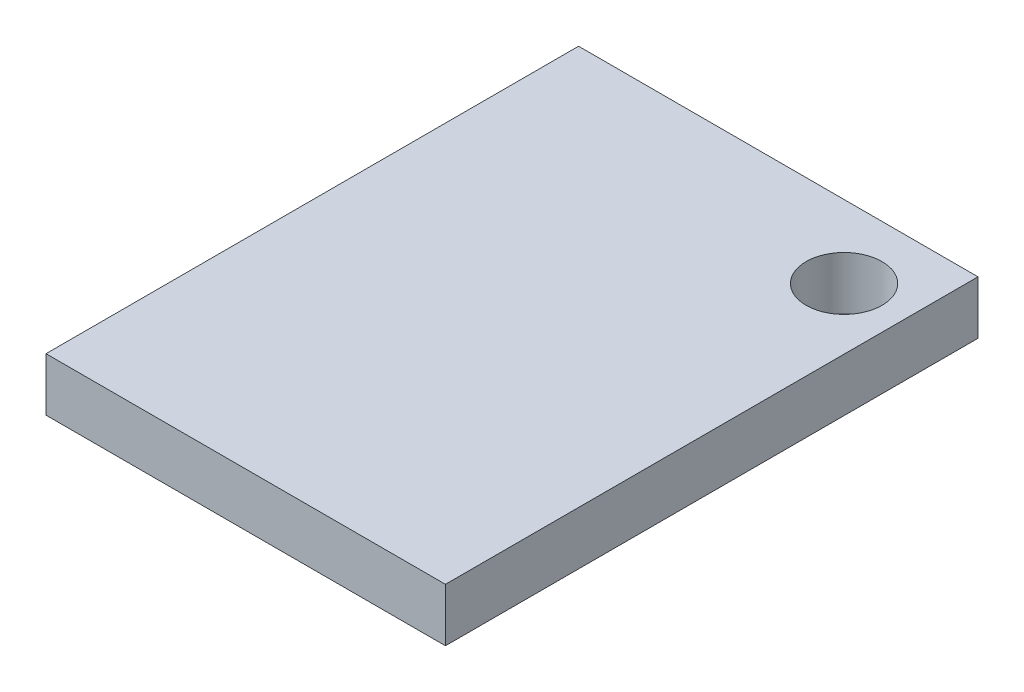
ISO-10303-21;
HEADER;
FILE_DESCRIPTION(('STEP AP214'),'2;1');
FILE_NAME('part.step','',(''),(''),'','','');
FILE_SCHEMA(('AUTOMOTIVE_DESIGN { 1 0 10303 214 1 1 1 1 }'));
ENDSEC;
DATA;
#1=APPLICATION_CONTEXT('core data for automotive mechanical design processes');
#2=APPLICATION_PROTOCOL_DEFINITION('international standard','automotive_design',2000,#1);
#3=PRODUCT_CONTEXT('',#1,'mechanical');
#4=PRODUCT('Part','Part','',(#3));
#5=PRODUCT_RELATED_PRODUCT_CATEGORY('part','',(#4));
#6=PRODUCT_DEFINITION_FORMATION('','',#4);
#7=PRODUCT_DEFINITION_CONTEXT('part definition',#1,'design');
#8=PRODUCT_DEFINITION('design','',#6,#7);
#9=PRODUCT_DEFINITION_SHAPE('','',#8);
#10=(LENGTH_UNIT() NAMED_UNIT(*) SI_UNIT(.MILLI.,.METRE.));
#11=(NAMED_UNIT(*) PLANE_ANGLE_UNIT() SI_UNIT($,.RADIAN.));
#12=(NAMED_UNIT(*) SI_UNIT($,.STERADIAN.) SOLID_ANGLE_UNIT());
#13=UNCERTAINTY_MEASURE_WITH_UNIT(LENGTH_MEASURE(1.E-05),#10,'distance_accuracy_value','');
#14=(GEOMETRIC_REPRESENTATION_CONTEXT(3) GLOBAL_UNCERTAINTY_ASSIGNED_CONTEXT((#13)) GLOBAL_UNIT_ASSIGNED_CONTEXT((#10,
#11,#12)) REPRESENTATION_CONTEXT('',''));
#15=CARTESIAN_POINT('',(0.,0.,0.));
#16=DIRECTION('',(0.,0.,1.));
#17=DIRECTION('',(1.,0.,0.));
#18=AXIS2_PLACEMENT_3D('',#15,#16,#17);
#19=CARTESIAN_POINT('',(7.5,2.,-10.));
#20=DIRECTION('',(-1.,0.,0.));
#21=DIRECTION('',(0.,0.,1.));
#22=AXIS2_PLACEMENT_3D('',#19,#20,#21);
#23=PLANE('',#22);
#24=DIRECTION('',(0.,0.,-1.));
#25=VECTOR('',#24,1.);
#26=CARTESIAN_POINT('',(7.5,0.,-10.));
#27=LINE('',#26,#25);
#28=CARTESIAN_POINT('',(7.5,0.,10.));
#29=VERTEX_POINT('',#28);
#30=CARTESIAN_POINT('',(7.5,0.,-10.));
#31=VERTEX_POINT('',#30);
#32=EDGE_CURVE('E96',#29,#31,#27,.T.);
#33=ORIENTED_EDGE('',*,*,#32,.T.);
#34=DIRECTION('',(0.,-1.,0.));
#35=VECTOR('',#34,1.);
#36=CARTESIAN_POINT('',(7.5,2.,-10.));
#37=LINE('',#36,#35);
#38=CARTESIAN_POINT('',(7.5,2.,-10.));
#39=VERTEX_POINT('',#38);
#40=EDGE_CURVE('E11',#39,#31,#37,.T.);
#41=ORIENTED_EDGE('',*,*,#40,.F.);
#42=DIRECTION('',(0.,0.,-1.));
#43=VECTOR('',#42,1.);
#44=CARTESIAN_POINT('',(7.5,2.,-10.));
#45=LINE('',#44,#43);
#46=CARTESIAN_POINT('',(7.5,2.,10.));
#47=VERTEX_POINT('',#46);
#48=EDGE_CURVE('E84',#47,#39,#45,.T.);
#49=ORIENTED_EDGE('',*,*,#48,.F.);
#50=DIRECTION('',(0.,-1.,0.));
#51=VECTOR('',#50,1.);
#52=CARTESIAN_POINT('',(7.5,2.,10.));
#53=LINE('',#52,#51);
#54=EDGE_CURVE('E92',#47,#29,#53,.T.);
#55=ORIENTED_EDGE('',*,*,#54,.T.);
#56=EDGE_LOOP('',(#33,#41,#49,#55));
#57=FACE_BOUND('',#56,.T.);
#58=ADVANCED_FACE('F33',(#57),#23,.F.);
#59=CARTESIAN_POINT('',(-7.5,2.,-10.));
#60=DIRECTION('',(0.,0.,1.));
#61=DIRECTION('',(1.,0.,0.));
#62=AXIS2_PLACEMENT_3D('',#59,#60,#61);
#63=PLANE('',#62);
#64=DIRECTION('',(-1.,0.,0.));
#65=VECTOR('',#64,1.);
#66=CARTESIAN_POINT('',(-7.5,0.,-10.));
#67=LINE('',#66,#65);
#68=CARTESIAN_POINT('',(-7.5,0.,-10.));
#69=VERTEX_POINT('',#68);
#70=EDGE_CURVE('E88',#31,#69,#67,.T.);
#71=ORIENTED_EDGE('',*,*,#70,.T.);
#72=DIRECTION('',(0.,-1.,0.));
#73=VECTOR('',#72,1.);
#74=CARTESIAN_POINT('',(-7.5,2.,-10.));
#75=LINE('',#74,#73);
#76=CARTESIAN_POINT('',(-7.5,2.,-10.));
#77=VERTEX_POINT('',#76);
#78=EDGE_CURVE('E41',#77,#69,#75,.T.);
#79=ORIENTED_EDGE('',*,*,#78,.F.);
#80=DIRECTION('',(-1.,0.,0.));
#81=VECTOR('',#80,1.);
#82=CARTESIAN_POINT('',(-7.5,2.,-10.));
#83=LINE('',#82,#81);
#84=EDGE_CURVE('E79',#39,#77,#83,.T.);
#85=ORIENTED_EDGE('',*,*,#84,.F.);
#86=ORIENTED_EDGE('',*,*,#40,.T.);
#87=EDGE_LOOP('',(#71,#79,#85,#86));
#88=FACE_BOUND('',#87,.T.);
#89=ADVANCED_FACE('F87',(#88),#63,.F.);
#90=CARTESIAN_POINT('',(-7.5,2.,-10.));
#91=DIRECTION('',(1.,0.,0.));
#92=DIRECTION('',(0.,0.,-1.));
#93=AXIS2_PLACEMENT_3D('',#90,#91,#92);
#94=PLANE('',#93);
#95=DIRECTION('',(0.,0.,1.));
#96=VECTOR('',#95,1.);
#97=CARTESIAN_POINT('',(-7.5,0.,-10.));
#98=LINE('',#97,#96);
#99=CARTESIAN_POINT('',(-7.5,0.,10.));
#100=VERTEX_POINT('',#99);
#101=EDGE_CURVE('E66',#69,#100,#98,.T.);
#102=ORIENTED_EDGE('',*,*,#101,.T.);
#103=DIRECTION('',(0.,-1.,0.));
#104=VECTOR('',#103,1.);
#105=CARTESIAN_POINT('',(-7.5,2.,10.));
#106=LINE('',#105,#104);
#107=CARTESIAN_POINT('',(-7.5,2.,10.));
#108=VERTEX_POINT('',#107);
#109=EDGE_CURVE('E89',#108,#100,#106,.T.);
#110=ORIENTED_EDGE('',*,*,#109,.F.);
#111=DIRECTION('',(0.,0.,1.));
#112=VECTOR('',#111,1.);
#113=CARTESIAN_POINT('',(-7.5,2.,-10.));
#114=LINE('',#113,#112);
#115=EDGE_CURVE('E82',#77,#108,#114,.T.);
#116=ORIENTED_EDGE('',*,*,#115,.F.);
#117=ORIENTED_EDGE('',*,*,#78,.T.);
#118=EDGE_LOOP('',(#102,#110,#116,#117));
#119=FACE_BOUND('',#118,.T.);
#120=ADVANCED_FACE('F90',(#119),#94,.F.);
#121=CARTESIAN_POINT('',(-7.5,2.,10.));
#122=DIRECTION('',(0.,0.,-1.));
#123=DIRECTION('',(-1.,0.,0.));
#124=AXIS2_PLACEMENT_3D('',#121,#122,#123);
#125=PLANE('',#124);
#126=DIRECTION('',(1.,0.,0.));
#127=VECTOR('',#126,1.);
#128=CARTESIAN_POINT('',(-7.5,0.,10.));
#129=LINE('',#128,#127);
#130=EDGE_CURVE('E72',#100,#29,#129,.T.);
#131=ORIENTED_EDGE('',*,*,#130,.T.);
#132=ORIENTED_EDGE('',*,*,#54,.F.);
#133=DIRECTION('',(1.,0.,0.));
#134=VECTOR('',#133,1.);
#135=CARTESIAN_POINT('',(-7.5,2.,10.));
#136=LINE('',#135,#134);
#137=EDGE_CURVE('E49',#108,#47,#136,.T.);
#138=ORIENTED_EDGE('',*,*,#137,.F.);
#139=ORIENTED_EDGE('',*,*,#109,.T.);
#140=EDGE_LOOP('',(#131,#132,#138,#139));
#141=FACE_BOUND('',#140,.T.);
#142=ADVANCED_FACE('F104',(#141),#125,.F.);
#143=CARTESIAN_POINT('',(0.,2.,0.));
#144=DIRECTION('',(0.,1.,0.));
#145=DIRECTION('',(0.,0.,1.));
#146=AXIS2_PLACEMENT_3D('',#143,#144,#145);
#147=PLANE('',#146);
#148=CARTESIAN_POINT('',(5.20095181997249,2.,-7.26962302434231));
#149=DIRECTION('',(0.,1.,0.));
#150=DIRECTION('',(0.,0.,1.));
#151=AXIS2_PLACEMENT_3D('',#148,#149,#150);
#152=CIRCLE('',#151,1.42519877819338);
#153=CARTESIAN_POINT('',(5.20095181997249,2.,-5.84442424614893));
#154=VERTEX_POINT('',#153);
#155=EDGE_CURVE('E110',#154,#154,#152,.T.);
#156=ORIENTED_EDGE('',*,*,#155,.F.);
#157=EDGE_LOOP('',(#156));
#158=FACE_BOUND('',#157,.T.);
#159=ORIENTED_EDGE('',*,*,#48,.T.);
#160=ORIENTED_EDGE('',*,*,#84,.T.);
#161=ORIENTED_EDGE('',*,*,#115,.T.);
#162=ORIENTED_EDGE('',*,*,#137,.T.);
#163=EDGE_LOOP('',(#159,#160,#161,#162));
#164=FACE_BOUND('',#163,.T.);
#165=ADVANCED_FACE('F80',(#158,#164),#147,.T.);
#166=CARTESIAN_POINT('',(0.,0.,0.));
#167=DIRECTION('',(0.,1.,0.));
#168=DIRECTION('',(0.,0.,1.));
#169=AXIS2_PLACEMENT_3D('',#166,#167,#168);
#170=PLANE('',#169);
#171=CARTESIAN_POINT('',(5.20095181997249,0.,-7.26962302434231));
#172=DIRECTION('',(0.,1.,0.));
#173=DIRECTION('',(0.,0.,1.));
#174=AXIS2_PLACEMENT_3D('',#171,#172,#173);
#175=CIRCLE('',#174,1.42519877819338);
#176=CARTESIAN_POINT('',(5.20095181997249,0.,-5.84442424614893));
#177=VERTEX_POINT('',#176);
#178=EDGE_CURVE('E99',#177,#177,#175,.T.);
#179=ORIENTED_EDGE('',*,*,#178,.T.);
#180=EDGE_LOOP('',(#179));
#181=FACE_BOUND('',#180,.T.);
#182=ORIENTED_EDGE('',*,*,#32,.F.);
#183=ORIENTED_EDGE('',*,*,#130,.F.);
#184=ORIENTED_EDGE('',*,*,#101,.F.);
#185=ORIENTED_EDGE('',*,*,#70,.F.);
#186=EDGE_LOOP('',(#182,#183,#184,#185));
#187=FACE_BOUND('',#186,.T.);
#188=ADVANCED_FACE('F107',(#181,#187),#170,.F.);
#189=CARTESIAN_POINT('',(5.20095181997249,0.,-7.26962302434231));
#190=DIRECTION('',(0.,1.,0.));
#191=DIRECTION('',(0.,0.,1.));
#192=AXIS2_PLACEMENT_3D('',#189,#190,#191);
#193=CYLINDRICAL_SURFACE('',#192,1.42519877819338);
#194=ORIENTED_EDGE('',*,*,#178,.F.);
#195=EDGE_LOOP('',(#194));
#196=FACE_BOUND('',#195,.T.);
#197=ORIENTED_EDGE('',*,*,#155,.T.);
#198=EDGE_LOOP('',(#197));
#199=FACE_BOUND('',#198,.T.);
#200=ADVANCED_FACE('F117',(#196,#199),#193,.F.);
#201=CLOSED_SHELL('',(#58,#89,#120,#142,#165,#188,#200));
#202=MANIFOLD_SOLID_BREP('B2',#201);
#203=ADVANCED_BREP_SHAPE_REPRESENTATION('',(#18,#202),#14);
#204=SHAPE_DEFINITION_REPRESENTATION(#9,#203);
ENDSEC;
END-ISO-10303-21;
